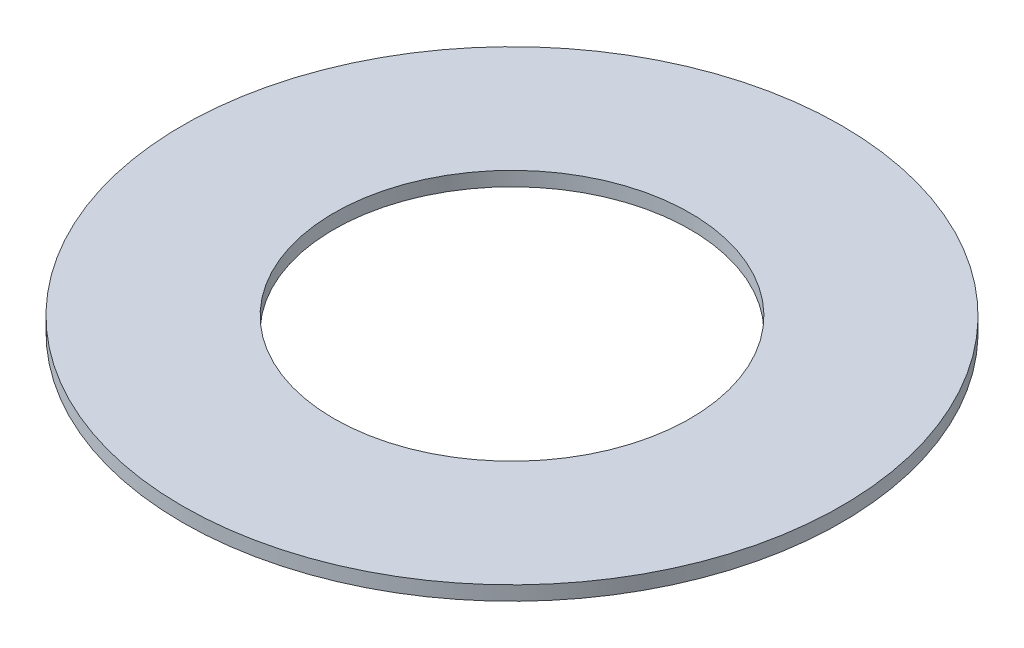
ISO-10303-21;
HEADER;
FILE_DESCRIPTION(('STEP AP214'),'2;1');
FILE_NAME('part.step','',(''),(''),'','','');
FILE_SCHEMA(('AUTOMOTIVE_DESIGN { 1 0 10303 214 1 1 1 1 }'));
ENDSEC;
DATA;
#1=APPLICATION_CONTEXT('core data for automotive mechanical design processes');
#2=APPLICATION_PROTOCOL_DEFINITION('international standard','automotive_design',2000,#1);
#3=PRODUCT_CONTEXT('',#1,'mechanical');
#4=PRODUCT('Part','Part','',(#3));
#5=PRODUCT_RELATED_PRODUCT_CATEGORY('part','',(#4));
#6=PRODUCT_DEFINITION_FORMATION('','',#4);
#7=PRODUCT_DEFINITION_CONTEXT('part definition',#1,'design');
#8=PRODUCT_DEFINITION('design','',#6,#7);
#9=PRODUCT_DEFINITION_SHAPE('','',#8);
#10=(LENGTH_UNIT() NAMED_UNIT(*) SI_UNIT(.MILLI.,.METRE.));
#11=(NAMED_UNIT(*) PLANE_ANGLE_UNIT() SI_UNIT($,.RADIAN.));
#12=(NAMED_UNIT(*) SI_UNIT($,.STERADIAN.) SOLID_ANGLE_UNIT());
#13=UNCERTAINTY_MEASURE_WITH_UNIT(LENGTH_MEASURE(1.E-05),#10,'distance_accuracy_value','');
#14=(GEOMETRIC_REPRESENTATION_CONTEXT(3) GLOBAL_UNCERTAINTY_ASSIGNED_CONTEXT((#13)) GLOBAL_UNIT_ASSIGNED_CONTEXT((#10,
#11,#12)) REPRESENTATION_CONTEXT('',''));
#15=CARTESIAN_POINT('',(0.,0.,0.));
#16=DIRECTION('',(0.,0.,1.));
#17=DIRECTION('',(1.,0.,0.));
#18=AXIS2_PLACEMENT_3D('',#15,#16,#17);
#19=CARTESIAN_POINT('',(0.,4.,0.));
#20=DIRECTION('',(0.,-1.,0.));
#21=DIRECTION('',(0.,0.,-1.));
#22=AXIS2_PLACEMENT_3D('',#19,#20,#21);
#23=CYLINDRICAL_SURFACE('',#22,92.5);
#24=CARTESIAN_POINT('',(0.,4.,0.));
#25=DIRECTION('',(0.,1.,0.));
#26=DIRECTION('',(0.,0.,1.));
#27=AXIS2_PLACEMENT_3D('',#24,#25,#26);
#28=CIRCLE('',#27,92.5);
#29=CARTESIAN_POINT('',(0.,4.,92.5));
#30=VERTEX_POINT('',#29);
#31=EDGE_CURVE('E10',#30,#30,#28,.T.);
#32=ORIENTED_EDGE('',*,*,#31,.F.);
#33=EDGE_LOOP('',(#32));
#34=FACE_BOUND('',#33,.T.);
#35=CARTESIAN_POINT('',(0.,0.,0.));
#36=DIRECTION('',(0.,1.,0.));
#37=DIRECTION('',(0.,0.,1.));
#38=AXIS2_PLACEMENT_3D('',#35,#36,#37);
#39=CIRCLE('',#38,92.5);
#40=CARTESIAN_POINT('',(0.,0.,92.5));
#41=VERTEX_POINT('',#40);
#42=EDGE_CURVE('E37',#41,#41,#39,.T.);
#43=ORIENTED_EDGE('',*,*,#42,.T.);
#44=EDGE_LOOP('',(#43));
#45=FACE_BOUND('',#44,.T.);
#46=ADVANCED_FACE('F40',(#34,#45),#23,.T.);
#47=CARTESIAN_POINT('',(0.,4.,0.));
#48=DIRECTION('',(0.,1.,0.));
#49=DIRECTION('',(0.,0.,1.));
#50=AXIS2_PLACEMENT_3D('',#47,#48,#49);
#51=PLANE('',#50);
#52=CARTESIAN_POINT('',(0.,4.,0.));
#53=DIRECTION('',(0.,1.,0.));
#54=DIRECTION('',(0.,0.,1.));
#55=AXIS2_PLACEMENT_3D('',#52,#53,#54);
#56=CIRCLE('',#55,50.);
#57=CARTESIAN_POINT('',(0.,4.,50.));
#58=VERTEX_POINT('',#57);
#59=EDGE_CURVE('E50',#58,#58,#56,.T.);
#60=ORIENTED_EDGE('',*,*,#59,.F.);
#61=EDGE_LOOP('',(#60));
#62=FACE_BOUND('',#61,.T.);
#63=ORIENTED_EDGE('',*,*,#31,.T.);
#64=EDGE_LOOP('',(#63));
#65=FACE_BOUND('',#64,.T.);
#66=ADVANCED_FACE('F59',(#62,#65),#51,.T.);
#67=CARTESIAN_POINT('',(0.,0.,0.));
#68=DIRECTION('',(0.,1.,0.));
#69=DIRECTION('',(0.,0.,1.));
#70=AXIS2_PLACEMENT_3D('',#67,#68,#69);
#71=PLANE('',#70);
#72=CARTESIAN_POINT('',(0.,0.,0.));
#73=DIRECTION('',(0.,1.,0.));
#74=DIRECTION('',(0.,0.,1.));
#75=AXIS2_PLACEMENT_3D('',#72,#73,#74);
#76=CIRCLE('',#75,50.);
#77=CARTESIAN_POINT('',(0.,0.,50.));
#78=VERTEX_POINT('',#77);
#79=EDGE_CURVE('E47',#78,#78,#76,.T.);
#80=ORIENTED_EDGE('',*,*,#79,.T.);
#81=EDGE_LOOP('',(#80));
#82=FACE_BOUND('',#81,.T.);
#83=ORIENTED_EDGE('',*,*,#42,.F.);
#84=EDGE_LOOP('',(#83));
#85=FACE_BOUND('',#84,.T.);
#86=ADVANCED_FACE('F58',(#82,#85),#71,.F.);
#87=CARTESIAN_POINT('',(0.,4.,0.));
#88=DIRECTION('',(0.,-1.,0.));
#89=DIRECTION('',(0.,0.,-1.));
#90=AXIS2_PLACEMENT_3D('',#87,#88,#89);
#91=CYLINDRICAL_SURFACE('',#90,50.);
#92=ORIENTED_EDGE('',*,*,#59,.T.);
#93=EDGE_LOOP('',(#92));
#94=FACE_BOUND('',#93,.T.);
#95=ORIENTED_EDGE('',*,*,#79,.F.);
#96=EDGE_LOOP('',(#95));
#97=FACE_BOUND('',#96,.T.);
#98=ADVANCED_FACE('F54',(#94,#97),#91,.F.);
#99=CLOSED_SHELL('',(#46,#66,#86,#98));
#100=MANIFOLD_SOLID_BREP('B2',#99);
#101=ADVANCED_BREP_SHAPE_REPRESENTATION('',(#18,#100),#14);
#102=SHAPE_DEFINITION_REPRESENTATION(#9,#101);
ENDSEC;
END-ISO-10303-21;
